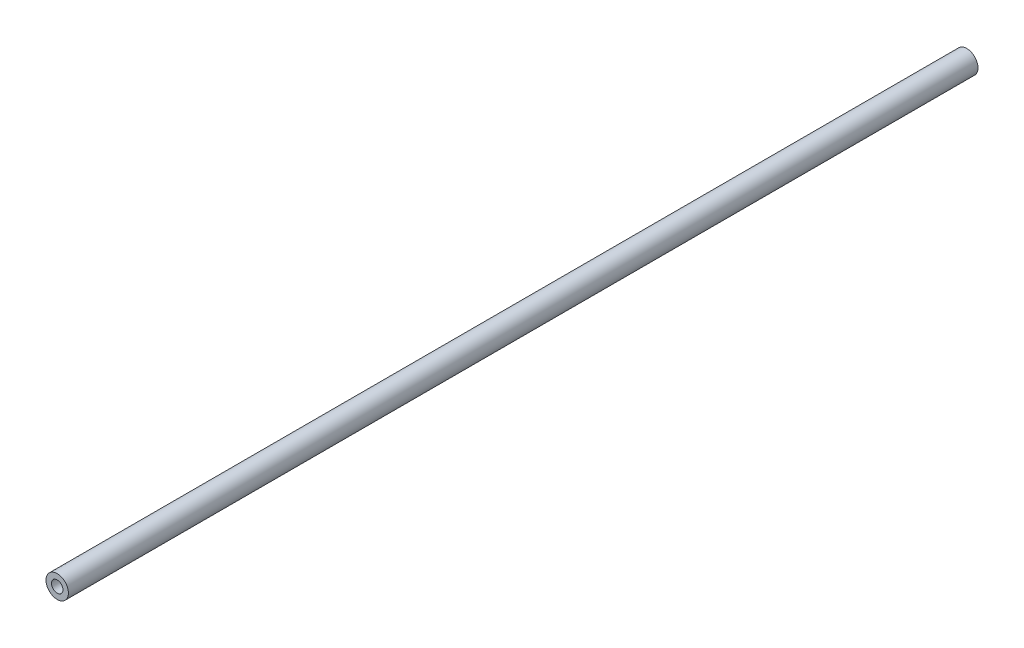
ISO-10303-21;
HEADER;
FILE_DESCRIPTION(('STEP AP214'),'2;1');
FILE_NAME('part.step','',(''),(''),'','','');
FILE_SCHEMA(('AUTOMOTIVE_DESIGN { 1 0 10303 214 1 1 1 1 }'));
ENDSEC;
DATA;
#1=APPLICATION_CONTEXT('core data for automotive mechanical design processes');
#2=APPLICATION_PROTOCOL_DEFINITION('international standard','automotive_design',2000,#1);
#3=PRODUCT_CONTEXT('',#1,'mechanical');
#4=PRODUCT('Part','Part','',(#3));
#5=PRODUCT_RELATED_PRODUCT_CATEGORY('part','',(#4));
#6=PRODUCT_DEFINITION_FORMATION('','',#4);
#7=PRODUCT_DEFINITION_CONTEXT('part definition',#1,'design');
#8=PRODUCT_DEFINITION('design','',#6,#7);
#9=PRODUCT_DEFINITION_SHAPE('','',#8);
#10=(LENGTH_UNIT() NAMED_UNIT(*) SI_UNIT(.MILLI.,.METRE.));
#11=(NAMED_UNIT(*) PLANE_ANGLE_UNIT() SI_UNIT($,.RADIAN.));
#12=(NAMED_UNIT(*) SI_UNIT($,.STERADIAN.) SOLID_ANGLE_UNIT());
#13=UNCERTAINTY_MEASURE_WITH_UNIT(LENGTH_MEASURE(1.E-05),#10,'distance_accuracy_value','');
#14=(GEOMETRIC_REPRESENTATION_CONTEXT(3) GLOBAL_UNCERTAINTY_ASSIGNED_CONTEXT((#13)) GLOBAL_UNIT_ASSIGNED_CONTEXT((#10,
#11,#12)) REPRESENTATION_CONTEXT('',''));
#15=CARTESIAN_POINT('',(0.,0.,0.));
#16=DIRECTION('',(0.,0.,1.));
#17=DIRECTION('',(1.,0.,0.));
#18=AXIS2_PLACEMENT_3D('',#15,#16,#17);
#19=CARTESIAN_POINT('',(0.,0.,150.));
#20=DIRECTION('',(0.,0.,1.));
#21=DIRECTION('',(1.,0.,0.));
#22=AXIS2_PLACEMENT_3D('',#19,#20,#21);
#23=PLANE('',#22);
#24=CARTESIAN_POINT('',(0.,0.,150.));
#25=DIRECTION('',(0.,0.,1.));
#26=DIRECTION('',(1.,0.,0.));
#27=AXIS2_PLACEMENT_3D('',#24,#25,#26);
#28=CIRCLE('',#27,1.85);
#29=CARTESIAN_POINT('',(1.85,0.,150.));
#30=VERTEX_POINT('',#29);
#31=EDGE_CURVE('E10',#30,#30,#28,.T.);
#32=ORIENTED_EDGE('',*,*,#31,.T.);
#33=EDGE_LOOP('',(#32));
#34=FACE_BOUND('',#33,.T.);
#35=CARTESIAN_POINT('',(0.,0.,150.));
#36=DIRECTION('',(0.,0.,1.));
#37=DIRECTION('',(1.,0.,0.));
#38=AXIS2_PLACEMENT_3D('',#35,#36,#37);
#39=CIRCLE('',#38,0.95);
#40=CARTESIAN_POINT('',(0.95,0.,150.));
#41=VERTEX_POINT('',#40);
#42=EDGE_CURVE('E46',#41,#41,#39,.T.);
#43=ORIENTED_EDGE('',*,*,#42,.F.);
#44=EDGE_LOOP('',(#43));
#45=FACE_BOUND('',#44,.T.);
#46=ADVANCED_FACE('F35',(#34,#45),#23,.T.);
#47=CARTESIAN_POINT('',(0.,0.,0.));
#48=DIRECTION('',(0.,0.,1.));
#49=DIRECTION('',(1.,0.,0.));
#50=AXIS2_PLACEMENT_3D('',#47,#48,#49);
#51=PLANE('',#50);
#52=CARTESIAN_POINT('',(0.,0.,0.));
#53=DIRECTION('',(0.,0.,1.));
#54=DIRECTION('',(1.,0.,0.));
#55=AXIS2_PLACEMENT_3D('',#52,#53,#54);
#56=CIRCLE('',#55,1.85);
#57=CARTESIAN_POINT('',(1.85,0.,0.));
#58=VERTEX_POINT('',#57);
#59=EDGE_CURVE('E39',#58,#58,#56,.T.);
#60=ORIENTED_EDGE('',*,*,#59,.F.);
#61=EDGE_LOOP('',(#60));
#62=FACE_BOUND('',#61,.T.);
#63=CARTESIAN_POINT('',(0.,0.,0.));
#64=DIRECTION('',(0.,0.,1.));
#65=DIRECTION('',(1.,0.,0.));
#66=AXIS2_PLACEMENT_3D('',#63,#64,#65);
#67=CIRCLE('',#66,0.95);
#68=CARTESIAN_POINT('',(0.95,0.,0.));
#69=VERTEX_POINT('',#68);
#70=EDGE_CURVE('E48',#69,#69,#67,.T.);
#71=ORIENTED_EDGE('',*,*,#70,.T.);
#72=EDGE_LOOP('',(#71));
#73=FACE_BOUND('',#72,.T.);
#74=ADVANCED_FACE('F58',(#62,#73),#51,.F.);
#75=CARTESIAN_POINT('',(0.,0.,150.));
#76=DIRECTION('',(0.,0.,-1.));
#77=DIRECTION('',(-1.,0.,0.));
#78=AXIS2_PLACEMENT_3D('',#75,#76,#77);
#79=CYLINDRICAL_SURFACE('',#78,1.85);
#80=ORIENTED_EDGE('',*,*,#31,.F.);
#81=EDGE_LOOP('',(#80));
#82=FACE_BOUND('',#81,.T.);
#83=ORIENTED_EDGE('',*,*,#59,.T.);
#84=EDGE_LOOP('',(#83));
#85=FACE_BOUND('',#84,.T.);
#86=ADVANCED_FACE('F37',(#82,#85),#79,.T.);
#87=CARTESIAN_POINT('',(0.,0.,150.));
#88=DIRECTION('',(0.,0.,-1.));
#89=DIRECTION('',(-1.,0.,0.));
#90=AXIS2_PLACEMENT_3D('',#87,#88,#89);
#91=CYLINDRICAL_SURFACE('',#90,0.95);
#92=ORIENTED_EDGE('',*,*,#42,.T.);
#93=EDGE_LOOP('',(#92));
#94=FACE_BOUND('',#93,.T.);
#95=ORIENTED_EDGE('',*,*,#70,.F.);
#96=EDGE_LOOP('',(#95));
#97=FACE_BOUND('',#96,.T.);
#98=ADVANCED_FACE('F54',(#94,#97),#91,.F.);
#99=CLOSED_SHELL('',(#46,#74,#86,#98));
#100=MANIFOLD_SOLID_BREP('B2',#99);
#101=ADVANCED_BREP_SHAPE_REPRESENTATION('',(#18,#100),#14);
#102=SHAPE_DEFINITION_REPRESENTATION(#9,#101);
ENDSEC;
END-ISO-10303-21;
